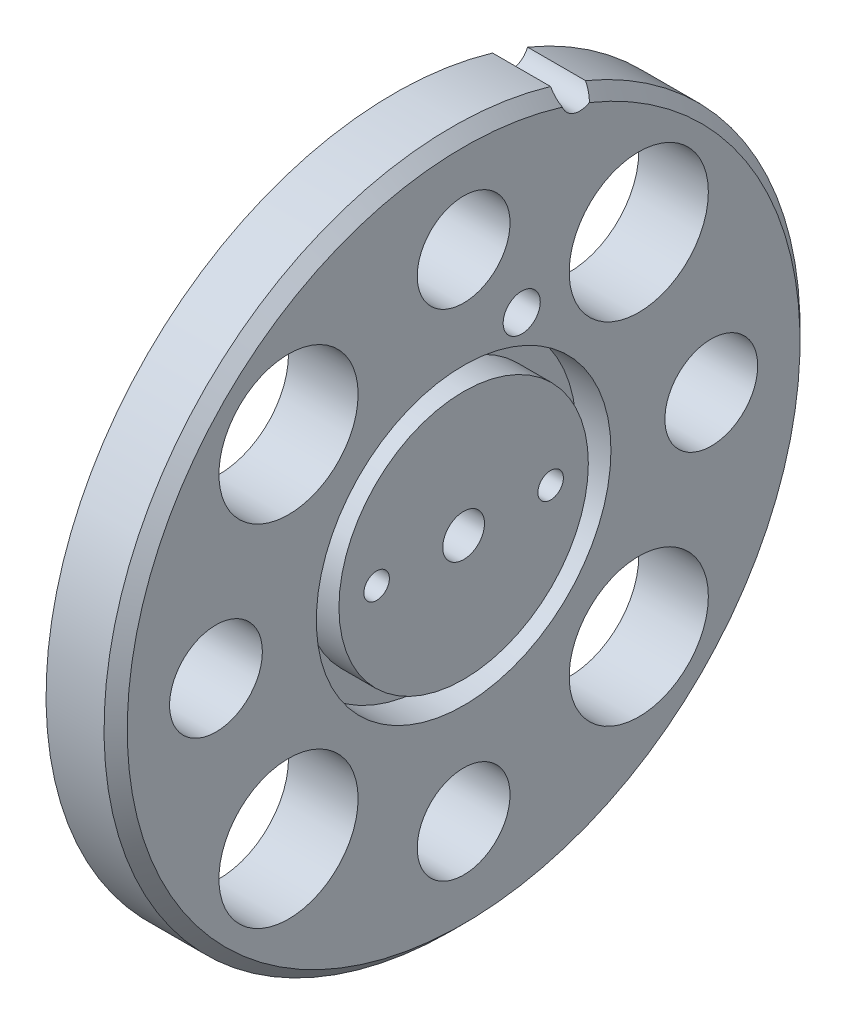
ISO-10303-21;
HEADER;
FILE_DESCRIPTION(('STEP AP214'),'2;1');
FILE_NAME('part.step','',(''),(''),'','','');
FILE_SCHEMA(('AUTOMOTIVE_DESIGN { 1 0 10303 214 1 1 1 1 }'));
ENDSEC;
DATA;
#1=APPLICATION_CONTEXT('core data for automotive mechanical design processes');
#2=APPLICATION_PROTOCOL_DEFINITION('international standard','automotive_design',2000,#1);
#3=PRODUCT_CONTEXT('',#1,'mechanical');
#4=PRODUCT('Part','Part','',(#3));
#5=PRODUCT_RELATED_PRODUCT_CATEGORY('part','',(#4));
#6=PRODUCT_DEFINITION_FORMATION('','',#4);
#7=PRODUCT_DEFINITION_CONTEXT('part definition',#1,'design');
#8=PRODUCT_DEFINITION('design','',#6,#7);
#9=PRODUCT_DEFINITION_SHAPE('','',#8);
#10=(LENGTH_UNIT() NAMED_UNIT(*) SI_UNIT(.MILLI.,.METRE.));
#11=(NAMED_UNIT(*) PLANE_ANGLE_UNIT() SI_UNIT($,.RADIAN.));
#12=(NAMED_UNIT(*) SI_UNIT($,.STERADIAN.) SOLID_ANGLE_UNIT());
#13=UNCERTAINTY_MEASURE_WITH_UNIT(LENGTH_MEASURE(1.E-05),#10,'distance_accuracy_value','');
#14=(GEOMETRIC_REPRESENTATION_CONTEXT(3) GLOBAL_UNCERTAINTY_ASSIGNED_CONTEXT((#13)) GLOBAL_UNIT_ASSIGNED_CONTEXT((#10,
#11,#12)) REPRESENTATION_CONTEXT('',''));
#15=CARTESIAN_POINT('',(0.,0.,0.));
#16=DIRECTION('',(0.,0.,1.));
#17=DIRECTION('',(1.,0.,0.));
#18=AXIS2_PLACEMENT_3D('',#15,#16,#17);
#19=CARTESIAN_POINT('',(6.,14.1396223663827,-5.00710288850657));
#20=DIRECTION('',(1.,0.,0.));
#21=DIRECTION('',(0.,0.,-1.));
#22=AXIS2_PLACEMENT_3D('',#19,#20,#21);
#23=PLANE('',#22);
#24=CARTESIAN_POINT('',(6.,0.,7.5));
#25=DIRECTION('',(1.,0.,0.));
#26=DIRECTION('',(0.,0.,1.));
#27=AXIS2_PLACEMENT_3D('',#24,#25,#26);
#28=CIRCLE('',#27,1.1);
#29=CARTESIAN_POINT('',(6.,0.,8.6));
#30=VERTEX_POINT('',#29);
#31=EDGE_CURVE('E186',#30,#30,#28,.T.);
#32=ORIENTED_EDGE('',*,*,#31,.F.);
#33=EDGE_LOOP('',(#32));
#34=FACE_BOUND('',#33,.T.);
#35=CARTESIAN_POINT('',(6.,0.,0.));
#36=DIRECTION('',(1.,0.,0.));
#37=DIRECTION('',(0.,0.,-1.));
#38=AXIS2_PLACEMENT_3D('',#35,#36,#37);
#39=CIRCLE('',#38,1.8);
#40=CARTESIAN_POINT('',(6.,0.,-1.8));
#41=VERTEX_POINT('',#40);
#42=EDGE_CURVE('E80',#41,#41,#39,.T.);
#43=ORIENTED_EDGE('',*,*,#42,.F.);
#44=EDGE_LOOP('',(#43));
#45=FACE_BOUND('',#44,.T.);
#46=CARTESIAN_POINT('',(6.,0.,-7.5));
#47=DIRECTION('',(1.,0.,0.));
#48=DIRECTION('',(0.,0.,-1.));
#49=AXIS2_PLACEMENT_3D('',#46,#47,#48);
#50=CIRCLE('',#49,1.1);
#51=CARTESIAN_POINT('',(6.,0.,-8.6));
#52=VERTEX_POINT('',#51);
#53=EDGE_CURVE('E192',#52,#52,#50,.T.);
#54=ORIENTED_EDGE('',*,*,#53,.F.);
#55=EDGE_LOOP('',(#54));
#56=FACE_BOUND('',#55,.T.);
#57=CARTESIAN_POINT('',(6.,0.,0.));
#58=DIRECTION('',(1.,0.,0.));
#59=DIRECTION('',(0.,0.,-1.));
#60=AXIS2_PLACEMENT_3D('',#57,#58,#59);
#61=CIRCLE('',#60,10.75);
#62=CARTESIAN_POINT('',(6.,0.,-10.75));
#63=VERTEX_POINT('',#62);
#64=EDGE_CURVE('E195',#63,#63,#61,.T.);
#65=ORIENTED_EDGE('',*,*,#64,.T.);
#66=EDGE_LOOP('',(#65));
#67=FACE_BOUND('',#66,.T.);
#68=ADVANCED_FACE('F32',(#34,#45,#56,#67),#23,.T.);
#69=CARTESIAN_POINT('',(6.,14.1396223663827,-5.00710288850657));
#70=DIRECTION('',(1.,0.,0.));
#71=DIRECTION('',(0.,0.,-1.));
#72=AXIS2_PLACEMENT_3D('',#69,#70,#71);
#73=CIRCLE('',#72,1.6);
#74=CARTESIAN_POINT('',(6.,14.1396223663827,-6.60710288850658));
#75=VERTEX_POINT('',#74);
#76=EDGE_CURVE('E203',#75,#75,#73,.T.);
#77=ORIENTED_EDGE('',*,*,#76,.F.);
#78=EDGE_LOOP('',(#77));
#79=FACE_BOUND('',#78,.T.);
#80=CARTESIAN_POINT('',(6.,0.,0.));
#81=DIRECTION('',(1.,0.,0.));
#82=DIRECTION('',(0.,0.,-1.));
#83=AXIS2_PLACEMENT_3D('',#80,#81,#82);
#84=CIRCLE('',#83,12.7);
#85=CARTESIAN_POINT('',(6.,0.,-12.7));
#86=VERTEX_POINT('',#85);
#87=EDGE_CURVE('E201',#86,#86,#84,.T.);
#88=ORIENTED_EDGE('',*,*,#87,.F.);
#89=EDGE_LOOP('',(#88));
#90=FACE_BOUND('',#89,.T.);
#91=CARTESIAN_POINT('',(6.,15.096729778333,15.0967297783326));
#92=DIRECTION('',(1.,0.,0.));
#93=DIRECTION('',(0.,0.,-1.));
#94=AXIS2_PLACEMENT_3D('',#91,#92,#93);
#95=CIRCLE('',#94,6.);
#96=CARTESIAN_POINT('',(6.,15.096729778333,9.09672977833255));
#97=VERTEX_POINT('',#96);
#98=EDGE_CURVE('E219',#97,#97,#95,.T.);
#99=ORIENTED_EDGE('',*,*,#98,.F.);
#100=EDGE_LOOP('',(#99));
#101=FACE_BOUND('',#100,.T.);
#102=CARTESIAN_POINT('',(6.,-15.0967297783326,15.096729778333));
#103=DIRECTION('',(1.,0.,0.));
#104=DIRECTION('',(0.,0.,-1.));
#105=AXIS2_PLACEMENT_3D('',#102,#103,#104);
#106=CIRCLE('',#105,6.);
#107=CARTESIAN_POINT('',(6.,-15.0967297783326,9.09672977833297));
#108=VERTEX_POINT('',#107);
#109=EDGE_CURVE('E231',#108,#108,#106,.T.);
#110=ORIENTED_EDGE('',*,*,#109,.F.);
#111=EDGE_LOOP('',(#110));
#112=FACE_BOUND('',#111,.T.);
#113=CARTESIAN_POINT('',(6.,-15.0967297783329,-15.0967297783327));
#114=DIRECTION('',(1.,0.,0.));
#115=DIRECTION('',(0.,0.,-1.));
#116=AXIS2_PLACEMENT_3D('',#113,#114,#115);
#117=CIRCLE('',#116,6.);
#118=CARTESIAN_POINT('',(6.,-15.0967297783329,-21.0967297783327));
#119=VERTEX_POINT('',#118);
#120=EDGE_CURVE('E243',#119,#119,#117,.T.);
#121=ORIENTED_EDGE('',*,*,#120,.F.);
#122=EDGE_LOOP('',(#121));
#123=FACE_BOUND('',#122,.T.);
#124=CARTESIAN_POINT('',(6.,15.0967297783327,-15.0967297783329));
#125=DIRECTION('',(1.,0.,0.));
#126=DIRECTION('',(0.,0.,-1.));
#127=AXIS2_PLACEMENT_3D('',#124,#125,#126);
#128=CIRCLE('',#127,6.);
#129=CARTESIAN_POINT('',(6.,15.0967297783327,-21.0967297783329));
#130=VERTEX_POINT('',#129);
#131=EDGE_CURVE('E255',#130,#130,#128,.T.);
#132=ORIENTED_EDGE('',*,*,#131,.F.);
#133=EDGE_LOOP('',(#132));
#134=FACE_BOUND('',#133,.T.);
#135=CARTESIAN_POINT('',(6.,28.2792447327653,-10.0142057770131));
#136=DIRECTION('',(-1.,0.,0.));
#137=DIRECTION('',(0.,0.,-1.));
#138=AXIS2_PLACEMENT_3D('',#135,#136,#137);
#139=CIRCLE('',#138,1.6);
#140=CARTESIAN_POINT('',(6.,26.9022694533807,-10.829030347067));
#141=VERTEX_POINT('',#140);
#142=CARTESIAN_POINT('',(6.,27.7219196724288,-8.51440953181153));
#143=VERTEX_POINT('',#142);
#144=EDGE_CURVE('E77',#141,#143,#139,.T.);
#145=ORIENTED_EDGE('',*,*,#144,.T.);
#146=CARTESIAN_POINT('',(6.,0.,0.));
#147=DIRECTION('',(1.,0.,0.));
#148=DIRECTION('',(0.,0.,-1.));
#149=AXIS2_PLACEMENT_3D('',#146,#147,#148);
#150=CIRCLE('',#149,29.);
#151=EDGE_CURVE('E70',#143,#141,#150,.T.);
#152=ORIENTED_EDGE('',*,*,#151,.T.);
#153=EDGE_LOOP('',(#145,#152));
#154=FACE_BOUND('',#153,.T.);
#155=CARTESIAN_POINT('',(6.,21.35,0.));
#156=DIRECTION('',(1.,0.,0.));
#157=DIRECTION('',(0.,0.,-1.));
#158=AXIS2_PLACEMENT_3D('',#155,#156,#157);
#159=CIRCLE('',#158,4.);
#160=CARTESIAN_POINT('',(6.,21.35,-4.));
#161=VERTEX_POINT('',#160);
#162=EDGE_CURVE('E249',#161,#161,#159,.T.);
#163=ORIENTED_EDGE('',*,*,#162,.F.);
#164=EDGE_LOOP('',(#163));
#165=FACE_BOUND('',#164,.T.);
#166=CARTESIAN_POINT('',(6.,0.,-21.35));
#167=DIRECTION('',(1.,0.,0.));
#168=DIRECTION('',(0.,0.,-1.));
#169=AXIS2_PLACEMENT_3D('',#166,#167,#168);
#170=CIRCLE('',#169,4.);
#171=CARTESIAN_POINT('',(6.,0.,-25.35));
#172=VERTEX_POINT('',#171);
#173=EDGE_CURVE('E237',#172,#172,#170,.T.);
#174=ORIENTED_EDGE('',*,*,#173,.F.);
#175=EDGE_LOOP('',(#174));
#176=FACE_BOUND('',#175,.T.);
#177=CARTESIAN_POINT('',(6.,-21.35,1.45616806216648E-13));
#178=DIRECTION('',(1.,0.,0.));
#179=DIRECTION('',(0.,0.,-1.));
#180=AXIS2_PLACEMENT_3D('',#177,#178,#179);
#181=CIRCLE('',#180,4.);
#182=CARTESIAN_POINT('',(6.,-21.35,-3.99999999999985));
#183=VERTEX_POINT('',#182);
#184=EDGE_CURVE('E225',#183,#183,#181,.T.);
#185=ORIENTED_EDGE('',*,*,#184,.F.);
#186=EDGE_LOOP('',(#185));
#187=FACE_BOUND('',#186,.T.);
#188=CARTESIAN_POINT('',(6.,2.23629379752903E-13,21.35));
#189=DIRECTION('',(1.,0.,0.));
#190=DIRECTION('',(0.,0.,-1.));
#191=AXIS2_PLACEMENT_3D('',#188,#189,#190);
#192=CIRCLE('',#191,4.);
#193=CARTESIAN_POINT('',(6.,2.23629379752903E-13,17.35));
#194=VERTEX_POINT('',#193);
#195=EDGE_CURVE('E213',#194,#194,#192,.T.);
#196=ORIENTED_EDGE('',*,*,#195,.F.);
#197=EDGE_LOOP('',(#196));
#198=FACE_BOUND('',#197,.T.);
#199=ADVANCED_FACE('F107',(#79,#90,#101,#112,#123,#134,#154,#165,#176,#187,#198),#23,.T.);
#200=CARTESIAN_POINT('',(0.,14.1396223663827,-5.00710288850657));
#201=DIRECTION('',(1.,0.,0.));
#202=DIRECTION('',(0.,0.,-1.));
#203=AXIS2_PLACEMENT_3D('',#200,#201,#202);
#204=PLANE('',#203);
#205=CARTESIAN_POINT('',(0.,15.096729778333,15.0967297783326));
#206=DIRECTION('',(1.,0.,0.));
#207=DIRECTION('',(0.,0.,-1.));
#208=AXIS2_PLACEMENT_3D('',#205,#206,#207);
#209=CIRCLE('',#208,6.);
#210=CARTESIAN_POINT('',(0.,15.096729778333,9.09672977833255));
#211=VERTEX_POINT('',#210);
#212=EDGE_CURVE('E216',#211,#211,#209,.T.);
#213=ORIENTED_EDGE('',*,*,#212,.T.);
#214=EDGE_LOOP('',(#213));
#215=FACE_BOUND('',#214,.T.);
#216=CARTESIAN_POINT('',(0.,-15.0967297783326,15.096729778333));
#217=DIRECTION('',(1.,0.,0.));
#218=DIRECTION('',(0.,0.,-1.));
#219=AXIS2_PLACEMENT_3D('',#216,#217,#218);
#220=CIRCLE('',#219,6.);
#221=CARTESIAN_POINT('',(0.,-15.0967297783326,9.09672977833297));
#222=VERTEX_POINT('',#221);
#223=EDGE_CURVE('E228',#222,#222,#220,.T.);
#224=ORIENTED_EDGE('',*,*,#223,.T.);
#225=EDGE_LOOP('',(#224));
#226=FACE_BOUND('',#225,.T.);
#227=CARTESIAN_POINT('',(0.,-15.0967297783329,-15.0967297783327));
#228=DIRECTION('',(1.,0.,0.));
#229=DIRECTION('',(0.,0.,-1.));
#230=AXIS2_PLACEMENT_3D('',#227,#228,#229);
#231=CIRCLE('',#230,6.);
#232=CARTESIAN_POINT('',(0.,-15.0967297783329,-21.0967297783327));
#233=VERTEX_POINT('',#232);
#234=EDGE_CURVE('E240',#233,#233,#231,.T.);
#235=ORIENTED_EDGE('',*,*,#234,.T.);
#236=EDGE_LOOP('',(#235));
#237=FACE_BOUND('',#236,.T.);
#238=CARTESIAN_POINT('',(0.,15.0967297783327,-15.0967297783329));
#239=DIRECTION('',(1.,0.,0.));
#240=DIRECTION('',(0.,0.,-1.));
#241=AXIS2_PLACEMENT_3D('',#238,#239,#240);
#242=CIRCLE('',#241,6.);
#243=CARTESIAN_POINT('',(0.,15.0967297783327,-21.0967297783329));
#244=VERTEX_POINT('',#243);
#245=EDGE_CURVE('E252',#244,#244,#242,.T.);
#246=ORIENTED_EDGE('',*,*,#245,.T.);
#247=EDGE_LOOP('',(#246));
#248=FACE_BOUND('',#247,.T.);
#249=CARTESIAN_POINT('',(0.,0.,-7.5));
#250=DIRECTION('',(1.,0.,0.));
#251=DIRECTION('',(0.,0.,-1.));
#252=AXIS2_PLACEMENT_3D('',#249,#250,#251);
#253=CIRCLE('',#252,1.1);
#254=CARTESIAN_POINT('',(0.,0.,-8.6));
#255=VERTEX_POINT('',#254);
#256=EDGE_CURVE('E262',#255,#255,#253,.T.);
#257=ORIENTED_EDGE('',*,*,#256,.T.);
#258=EDGE_LOOP('',(#257));
#259=FACE_BOUND('',#258,.T.);
#260=CARTESIAN_POINT('',(0.,28.2792447327653,-10.0142057770131));
#261=DIRECTION('',(-1.,0.,0.));
#262=DIRECTION('',(0.,0.,-1.));
#263=AXIS2_PLACEMENT_3D('',#260,#261,#262);
#264=CIRCLE('',#263,1.6);
#265=CARTESIAN_POINT('',(0.,27.7051243204898,-11.5076533831274));
#266=VERTEX_POINT('',#265);
#267=CARTESIAN_POINT('',(0.,28.7729264044677,-8.49227331891089));
#268=VERTEX_POINT('',#267);
#269=EDGE_CURVE('E76',#266,#268,#264,.T.);
#270=ORIENTED_EDGE('',*,*,#269,.F.);
#271=CARTESIAN_POINT('',(0.,0.,0.));
#272=DIRECTION('',(1.,0.,0.));
#273=DIRECTION('',(0.,0.,-1.));
#274=AXIS2_PLACEMENT_3D('',#271,#272,#273);
#275=CIRCLE('',#274,30.);
#276=EDGE_CURVE('E66',#268,#266,#275,.T.);
#277=ORIENTED_EDGE('',*,*,#276,.F.);
#278=EDGE_LOOP('',(#270,#277));
#279=FACE_BOUND('',#278,.T.);
#280=CARTESIAN_POINT('',(0.,0.,0.));
#281=DIRECTION('',(1.,0.,0.));
#282=DIRECTION('',(0.,0.,-1.));
#283=AXIS2_PLACEMENT_3D('',#280,#281,#282);
#284=CIRCLE('',#283,1.8);
#285=CARTESIAN_POINT('',(0.,0.,-1.8));
#286=VERTEX_POINT('',#285);
#287=EDGE_CURVE('E83',#286,#286,#284,.T.);
#288=ORIENTED_EDGE('',*,*,#287,.T.);
#289=EDGE_LOOP('',(#288));
#290=FACE_BOUND('',#289,.T.);
#291=CARTESIAN_POINT('',(0.,0.,7.5));
#292=DIRECTION('',(1.,0.,0.));
#293=DIRECTION('',(0.,0.,1.));
#294=AXIS2_PLACEMENT_3D('',#291,#292,#293);
#295=CIRCLE('',#294,1.1);
#296=CARTESIAN_POINT('',(0.,0.,8.6));
#297=VERTEX_POINT('',#296);
#298=EDGE_CURVE('E258',#297,#297,#295,.T.);
#299=ORIENTED_EDGE('',*,*,#298,.T.);
#300=EDGE_LOOP('',(#299));
#301=FACE_BOUND('',#300,.T.);
#302=CARTESIAN_POINT('',(0.,21.35,0.));
#303=DIRECTION('',(1.,0.,0.));
#304=DIRECTION('',(0.,0.,-1.));
#305=AXIS2_PLACEMENT_3D('',#302,#303,#304);
#306=CIRCLE('',#305,4.);
#307=CARTESIAN_POINT('',(0.,21.35,-4.));
#308=VERTEX_POINT('',#307);
#309=EDGE_CURVE('E246',#308,#308,#306,.T.);
#310=ORIENTED_EDGE('',*,*,#309,.T.);
#311=EDGE_LOOP('',(#310));
#312=FACE_BOUND('',#311,.T.);
#313=CARTESIAN_POINT('',(0.,0.,-21.35));
#314=DIRECTION('',(1.,0.,0.));
#315=DIRECTION('',(0.,0.,-1.));
#316=AXIS2_PLACEMENT_3D('',#313,#314,#315);
#317=CIRCLE('',#316,4.);
#318=CARTESIAN_POINT('',(0.,0.,-25.35));
#319=VERTEX_POINT('',#318);
#320=EDGE_CURVE('E234',#319,#319,#317,.T.);
#321=ORIENTED_EDGE('',*,*,#320,.T.);
#322=EDGE_LOOP('',(#321));
#323=FACE_BOUND('',#322,.T.);
#324=CARTESIAN_POINT('',(0.,-21.35,1.45616806216648E-13));
#325=DIRECTION('',(1.,0.,0.));
#326=DIRECTION('',(0.,0.,-1.));
#327=AXIS2_PLACEMENT_3D('',#324,#325,#326);
#328=CIRCLE('',#327,4.);
#329=CARTESIAN_POINT('',(0.,-21.35,-3.99999999999985));
#330=VERTEX_POINT('',#329);
#331=EDGE_CURVE('E222',#330,#330,#328,.T.);
#332=ORIENTED_EDGE('',*,*,#331,.T.);
#333=EDGE_LOOP('',(#332));
#334=FACE_BOUND('',#333,.T.);
#335=CARTESIAN_POINT('',(0.,2.23629379752903E-13,21.35));
#336=DIRECTION('',(1.,0.,0.));
#337=DIRECTION('',(0.,0.,-1.));
#338=AXIS2_PLACEMENT_3D('',#335,#336,#337);
#339=CIRCLE('',#338,4.);
#340=CARTESIAN_POINT('',(0.,2.23629379752903E-13,17.35));
#341=VERTEX_POINT('',#340);
#342=EDGE_CURVE('E210',#341,#341,#339,.T.);
#343=ORIENTED_EDGE('',*,*,#342,.T.);
#344=EDGE_LOOP('',(#343));
#345=FACE_BOUND('',#344,.T.);
#346=ADVANCED_FACE('F74',(#215,#226,#237,#248,#259,#279,#290,#301,#312,#323,#334,#345),#204,.F.);
#347=CARTESIAN_POINT('',(6.,28.2792447327653,-10.0142057770131));
#348=DIRECTION('',(-1.,0.,0.));
#349=DIRECTION('',(0.,0.,1.));
#350=AXIS2_PLACEMENT_3D('',#347,#348,#349);
#351=CYLINDRICAL_SURFACE('',#350,1.6);
#352=ORIENTED_EDGE('',*,*,#144,.F.);
#353=CARTESIAN_POINT('',(6.,26.9022694533807,-10.829030347067));
#354=CARTESIAN_POINT('',(5.95748152019924,26.9295529538725,-10.8751093636154));
#355=CARTESIAN_POINT('',(5.91396375522709,26.958696102256,-10.9191081823422));
#356=CARTESIAN_POINT('',(5.82537172577946,27.0202565363291,-11.002974342158));
#357=CARTESIAN_POINT('',(5.78029879158953,27.0526710672507,-11.0428451030183));
#358=CARTESIAN_POINT('',(5.68972673290477,27.1198122406809,-11.1179302610488));
#359=CARTESIAN_POINT('',(5.64424721098313,27.1544913806564,-11.1532111530702));
#360=CARTESIAN_POINT('',(5.55243042388235,27.2263266478308,-11.2199279143867));
#361=CARTESIAN_POINT('',(5.50609302944252,27.263483150539,-11.2513631987226));
#362=CARTESIAN_POINT('',(5.38437571343891,27.3633397731233,-11.3284284115042));
#363=CARTESIAN_POINT('',(5.30850944959288,27.4278045943657,-11.3710310297582));
#364=CARTESIAN_POINT('',(5.15505865362141,27.5625017435481,-11.4467893886981));
#365=CARTESIAN_POINT('',(5.07746482755841,27.6328010642749,-11.4798075058112));
#366=CARTESIAN_POINT('',(4.99999999999998,27.7051243204898,-11.5076533831275));
#367=B_SPLINE_CURVE_WITH_KNOTS('',3,(#353,#354,#355,#356,#357,#358,#359,#360,#361,#362,#363,
#364,#365,#366),.UNSPECIFIED.,.F.,.F.,(4,2,2,2,2,2,4),(0.,0.205012461223851,0.409853703469577,
0.611283140930392,0.812743180026222,1.1370018317428,1.46570909723937),.UNSPECIFIED.);
#368=CARTESIAN_POINT('',(4.99999999999998,27.7051243204898,-11.5076533831274));
#369=VERTEX_POINT('',#368);
#370=EDGE_CURVE('E41',#141,#369,#367,.T.);
#371=ORIENTED_EDGE('',*,*,#370,.T.);
#372=DIRECTION('',(-1.,0.,0.));
#373=VECTOR('',#372,1.);
#374=CARTESIAN_POINT('',(6.,27.7051243204898,-11.5076533831274));
#375=LINE('',#374,#373);
#376=EDGE_CURVE('E71',#369,#266,#375,.T.);
#377=ORIENTED_EDGE('',*,*,#376,.T.);
#378=ORIENTED_EDGE('',*,*,#269,.T.);
#379=DIRECTION('',(-1.,0.,0.));
#380=VECTOR('',#379,1.);
#381=CARTESIAN_POINT('',(6.,28.7729264044677,-8.49227331891089));
#382=LINE('',#381,#380);
#383=CARTESIAN_POINT('',(4.99999999999998,28.7729264044677,-8.49227331891089));
#384=VERTEX_POINT('',#383);
#385=EDGE_CURVE('E63',#384,#268,#382,.T.);
#386=ORIENTED_EDGE('',*,*,#385,.F.);
#387=CARTESIAN_POINT('',(4.99999999999998,28.7729264044677,-8.49227331891089));
#388=CARTESIAN_POINT('',(5.06262589698945,28.7133267812632,-8.47296011098664));
#389=CARTESIAN_POINT('',(5.12531277029409,28.6526428783644,-8.45712576825959));
#390=CARTESIAN_POINT('',(5.25044373557945,28.5294053532571,-8.43262770821674));
#391=CARTESIAN_POINT('',(5.31288728994577,28.4668489377996,-8.42397531950593));
#392=CARTESIAN_POINT('',(5.43553160612705,28.3418184680971,-8.41423039050746));
#393=CARTESIAN_POINT('',(5.4957508347309,28.2793759845721,-8.41296759892772));
#394=CARTESIAN_POINT('',(5.61485866447945,28.1536108949364,-8.41790597964186));
#395=CARTESIAN_POINT('',(5.67374846231312,28.0902891705848,-8.42410014238706));
#396=CARTESIAN_POINT('',(5.77767614636705,27.9762744075663,-8.44232092264019));
#397=CARTESIAN_POINT('',(5.8230667683746,27.925669191542,-8.45288182246745));
#398=CARTESIAN_POINT('',(5.91265644802329,27.8239709704875,-8.47944142140143));
#399=CARTESIAN_POINT('',(5.95684055023661,27.7728777943182,-8.4954896447831));
#400=CARTESIAN_POINT('',(6.,27.7219196724288,-8.51440953181153));
#401=B_SPLINE_CURVE_WITH_KNOTS('',3,(#387,#388,#389,#390,#391,#392,#393,#394,#395,#396,#397,
#398,#399,#400),.UNSPECIFIED.,.F.,.F.,(4,2,2,2,2,2,4),(0.,0.265699234545622,0.531816783140644,
0.791778252306828,1.05149554797202,1.25766844705409,1.46575348943601),.UNSPECIFIED.);
#402=EDGE_CURVE('E91',#384,#143,#401,.T.);
#403=ORIENTED_EDGE('',*,*,#402,.T.);
#404=EDGE_LOOP('',(#352,#371,#377,#378,#386,#403));
#405=FACE_BOUND('',#404,.T.);
#406=ADVANCED_FACE('F79',(#405),#351,.F.);
#407=CARTESIAN_POINT('',(6.,0.,0.));
#408=DIRECTION('',(-1.,0.,0.));
#409=DIRECTION('',(0.,0.,1.));
#410=AXIS2_PLACEMENT_3D('',#407,#408,#409);
#411=CYLINDRICAL_SURFACE('',#410,30.);
#412=ORIENTED_EDGE('',*,*,#376,.F.);
#413=CARTESIAN_POINT('',(4.99999999999998,0.,0.));
#414=DIRECTION('',(1.,0.,0.));
#415=DIRECTION('',(0.,0.,-1.));
#416=AXIS2_PLACEMENT_3D('',#413,#414,#415);
#417=CIRCLE('',#416,30.);
#418=EDGE_CURVE('E11',#369,#384,#417,.F.);
#419=ORIENTED_EDGE('',*,*,#418,.T.);
#420=ORIENTED_EDGE('',*,*,#385,.T.);
#421=ORIENTED_EDGE('',*,*,#276,.T.);
#422=EDGE_LOOP('',(#412,#419,#420,#421));
#423=FACE_BOUND('',#422,.T.);
#424=ADVANCED_FACE('F65',(#423),#411,.T.);
#425=CARTESIAN_POINT('',(6.,0.,0.));
#426=DIRECTION('',(-1.,0.,0.));
#427=DIRECTION('',(0.,0.,1.));
#428=AXIS2_PLACEMENT_3D('',#425,#426,#427);
#429=CYLINDRICAL_SURFACE('',#428,1.8);
#430=ORIENTED_EDGE('',*,*,#42,.T.);
#431=EDGE_LOOP('',(#430));
#432=FACE_BOUND('',#431,.T.);
#433=ORIENTED_EDGE('',*,*,#287,.F.);
#434=EDGE_LOOP('',(#433));
#435=FACE_BOUND('',#434,.T.);
#436=ADVANCED_FACE('F104',(#432,#435),#429,.F.);
#437=CARTESIAN_POINT('',(6.,0.,-7.5));
#438=DIRECTION('',(-1.,0.,0.));
#439=DIRECTION('',(0.,0.,1.));
#440=AXIS2_PLACEMENT_3D('',#437,#438,#439);
#441=CYLINDRICAL_SURFACE('',#440,1.1);
#442=ORIENTED_EDGE('',*,*,#53,.T.);
#443=EDGE_LOOP('',(#442));
#444=FACE_BOUND('',#443,.T.);
#445=ORIENTED_EDGE('',*,*,#256,.F.);
#446=EDGE_LOOP('',(#445));
#447=FACE_BOUND('',#446,.T.);
#448=ADVANCED_FACE('F114',(#444,#447),#441,.F.);
#449=CARTESIAN_POINT('',(6.,0.,7.5));
#450=DIRECTION('',(-1.,0.,0.));
#451=DIRECTION('',(0.,0.,1.));
#452=AXIS2_PLACEMENT_3D('',#449,#450,#451);
#453=CYLINDRICAL_SURFACE('',#452,1.1);
#454=ORIENTED_EDGE('',*,*,#31,.T.);
#455=EDGE_LOOP('',(#454));
#456=FACE_BOUND('',#455,.T.);
#457=ORIENTED_EDGE('',*,*,#298,.F.);
#458=EDGE_LOOP('',(#457));
#459=FACE_BOUND('',#458,.T.);
#460=ADVANCED_FACE('F118',(#456,#459),#453,.F.);
#461=CARTESIAN_POINT('',(6.,15.0967297783327,-15.0967297783329));
#462=DIRECTION('',(-1.,0.,0.));
#463=DIRECTION('',(0.,0.,1.));
#464=AXIS2_PLACEMENT_3D('',#461,#462,#463);
#465=CYLINDRICAL_SURFACE('',#464,6.);
#466=ORIENTED_EDGE('',*,*,#131,.T.);
#467=EDGE_LOOP('',(#466));
#468=FACE_BOUND('',#467,.T.);
#469=ORIENTED_EDGE('',*,*,#245,.F.);
#470=EDGE_LOOP('',(#469));
#471=FACE_BOUND('',#470,.T.);
#472=ADVANCED_FACE('F122',(#468,#471),#465,.F.);
#473=CARTESIAN_POINT('',(6.,21.35,0.));
#474=DIRECTION('',(-1.,0.,0.));
#475=DIRECTION('',(0.,0.,1.));
#476=AXIS2_PLACEMENT_3D('',#473,#474,#475);
#477=CYLINDRICAL_SURFACE('',#476,4.);
#478=ORIENTED_EDGE('',*,*,#162,.T.);
#479=EDGE_LOOP('',(#478));
#480=FACE_BOUND('',#479,.T.);
#481=ORIENTED_EDGE('',*,*,#309,.F.);
#482=EDGE_LOOP('',(#481));
#483=FACE_BOUND('',#482,.T.);
#484=ADVANCED_FACE('F126',(#480,#483),#477,.F.);
#485=CARTESIAN_POINT('',(6.,-15.0967297783329,-15.0967297783327));
#486=DIRECTION('',(-1.,0.,0.));
#487=DIRECTION('',(0.,0.,1.));
#488=AXIS2_PLACEMENT_3D('',#485,#486,#487);
#489=CYLINDRICAL_SURFACE('',#488,6.);
#490=ORIENTED_EDGE('',*,*,#120,.T.);
#491=EDGE_LOOP('',(#490));
#492=FACE_BOUND('',#491,.T.);
#493=ORIENTED_EDGE('',*,*,#234,.F.);
#494=EDGE_LOOP('',(#493));
#495=FACE_BOUND('',#494,.T.);
#496=ADVANCED_FACE('F130',(#492,#495),#489,.F.);
#497=CARTESIAN_POINT('',(6.,0.,-21.35));
#498=DIRECTION('',(-1.,0.,0.));
#499=DIRECTION('',(0.,0.,1.));
#500=AXIS2_PLACEMENT_3D('',#497,#498,#499);
#501=CYLINDRICAL_SURFACE('',#500,4.);
#502=ORIENTED_EDGE('',*,*,#173,.T.);
#503=EDGE_LOOP('',(#502));
#504=FACE_BOUND('',#503,.T.);
#505=ORIENTED_EDGE('',*,*,#320,.F.);
#506=EDGE_LOOP('',(#505));
#507=FACE_BOUND('',#506,.T.);
#508=ADVANCED_FACE('F134',(#504,#507),#501,.F.);
#509=CARTESIAN_POINT('',(6.,-15.0967297783326,15.096729778333));
#510=DIRECTION('',(-1.,0.,0.));
#511=DIRECTION('',(0.,0.,1.));
#512=AXIS2_PLACEMENT_3D('',#509,#510,#511);
#513=CYLINDRICAL_SURFACE('',#512,6.);
#514=ORIENTED_EDGE('',*,*,#109,.T.);
#515=EDGE_LOOP('',(#514));
#516=FACE_BOUND('',#515,.T.);
#517=ORIENTED_EDGE('',*,*,#223,.F.);
#518=EDGE_LOOP('',(#517));
#519=FACE_BOUND('',#518,.T.);
#520=ADVANCED_FACE('F138',(#516,#519),#513,.F.);
#521=CARTESIAN_POINT('',(6.,-21.35,1.45616806216648E-13));
#522=DIRECTION('',(-1.,0.,0.));
#523=DIRECTION('',(0.,0.,1.));
#524=AXIS2_PLACEMENT_3D('',#521,#522,#523);
#525=CYLINDRICAL_SURFACE('',#524,4.);
#526=ORIENTED_EDGE('',*,*,#184,.T.);
#527=EDGE_LOOP('',(#526));
#528=FACE_BOUND('',#527,.T.);
#529=ORIENTED_EDGE('',*,*,#331,.F.);
#530=EDGE_LOOP('',(#529));
#531=FACE_BOUND('',#530,.T.);
#532=ADVANCED_FACE('F142',(#528,#531),#525,.F.);
#533=CARTESIAN_POINT('',(6.,15.096729778333,15.0967297783326));
#534=DIRECTION('',(-1.,0.,0.));
#535=DIRECTION('',(0.,0.,1.));
#536=AXIS2_PLACEMENT_3D('',#533,#534,#535);
#537=CYLINDRICAL_SURFACE('',#536,6.);
#538=ORIENTED_EDGE('',*,*,#98,.T.);
#539=EDGE_LOOP('',(#538));
#540=FACE_BOUND('',#539,.T.);
#541=ORIENTED_EDGE('',*,*,#212,.F.);
#542=EDGE_LOOP('',(#541));
#543=FACE_BOUND('',#542,.T.);
#544=ADVANCED_FACE('F146',(#540,#543),#537,.F.);
#545=CARTESIAN_POINT('',(6.,2.23629379752903E-13,21.35));
#546=DIRECTION('',(-1.,0.,0.));
#547=DIRECTION('',(0.,0.,1.));
#548=AXIS2_PLACEMENT_3D('',#545,#546,#547);
#549=CYLINDRICAL_SURFACE('',#548,4.);
#550=ORIENTED_EDGE('',*,*,#195,.T.);
#551=EDGE_LOOP('',(#550));
#552=FACE_BOUND('',#551,.T.);
#553=ORIENTED_EDGE('',*,*,#342,.F.);
#554=EDGE_LOOP('',(#553));
#555=FACE_BOUND('',#554,.T.);
#556=ADVANCED_FACE('F150',(#552,#555),#549,.F.);
#557=CARTESIAN_POINT('',(3.,0.,0.));
#558=DIRECTION('',(1.,0.,0.));
#559=DIRECTION('',(0.,0.,-1.));
#560=AXIS2_PLACEMENT_3D('',#557,#558,#559);
#561=CYLINDRICAL_SURFACE('',#560,12.7);
#562=CARTESIAN_POINT('',(3.,0.,0.));
#563=DIRECTION('',(1.,0.,0.));
#564=DIRECTION('',(0.,0.,-1.));
#565=AXIS2_PLACEMENT_3D('',#562,#563,#564);
#566=CIRCLE('',#565,12.7);
#567=CARTESIAN_POINT('',(3.,0.,-12.7));
#568=VERTEX_POINT('',#567);
#569=EDGE_CURVE('E207',#568,#568,#566,.T.);
#570=ORIENTED_EDGE('',*,*,#569,.F.);
#571=EDGE_LOOP('',(#570));
#572=FACE_BOUND('',#571,.T.);
#573=ORIENTED_EDGE('',*,*,#87,.T.);
#574=EDGE_LOOP('',(#573));
#575=FACE_BOUND('',#574,.T.);
#576=ADVANCED_FACE('F154',(#572,#575),#561,.F.);
#577=CARTESIAN_POINT('',(3.,0.,0.));
#578=DIRECTION('',(1.,0.,0.));
#579=DIRECTION('',(0.,0.,-1.));
#580=AXIS2_PLACEMENT_3D('',#577,#578,#579);
#581=PLANE('',#580);
#582=CARTESIAN_POINT('',(3.,0.,0.));
#583=DIRECTION('',(1.,0.,0.));
#584=DIRECTION('',(0.,0.,-1.));
#585=AXIS2_PLACEMENT_3D('',#582,#583,#584);
#586=CIRCLE('',#585,10.75);
#587=CARTESIAN_POINT('',(3.,0.,-10.75));
#588=VERTEX_POINT('',#587);
#589=EDGE_CURVE('E197',#588,#588,#586,.T.);
#590=ORIENTED_EDGE('',*,*,#589,.F.);
#591=EDGE_LOOP('',(#590));
#592=FACE_BOUND('',#591,.T.);
#593=ORIENTED_EDGE('',*,*,#569,.T.);
#594=EDGE_LOOP('',(#593));
#595=FACE_BOUND('',#594,.T.);
#596=ADVANCED_FACE('F158',(#592,#595),#581,.T.);
#597=CARTESIAN_POINT('',(3.,0.,0.));
#598=DIRECTION('',(1.,0.,0.));
#599=DIRECTION('',(0.,0.,-1.));
#600=AXIS2_PLACEMENT_3D('',#597,#598,#599);
#601=CYLINDRICAL_SURFACE('',#600,10.75);
#602=ORIENTED_EDGE('',*,*,#589,.T.);
#603=EDGE_LOOP('',(#602));
#604=FACE_BOUND('',#603,.T.);
#605=ORIENTED_EDGE('',*,*,#64,.F.);
#606=EDGE_LOOP('',(#605));
#607=FACE_BOUND('',#606,.T.);
#608=ADVANCED_FACE('F162',(#604,#607),#601,.T.);
#609=CARTESIAN_POINT('',(3.,14.1396223663827,-5.00710288850657));
#610=DIRECTION('',(1.,0.,0.));
#611=DIRECTION('',(0.,0.,-1.));
#612=AXIS2_PLACEMENT_3D('',#609,#610,#611);
#613=CYLINDRICAL_SURFACE('',#612,1.6);
#614=CARTESIAN_POINT('',(3.,14.1396223663827,-5.00710288850657));
#615=DIRECTION('',(1.,0.,0.));
#616=DIRECTION('',(0.,0.,-1.));
#617=AXIS2_PLACEMENT_3D('',#614,#615,#616);
#618=CIRCLE('',#617,1.6);
#619=CARTESIAN_POINT('',(3.,14.1396223663827,-6.60710288850658));
#620=VERTEX_POINT('',#619);
#621=EDGE_CURVE('E198',#620,#620,#618,.T.);
#622=ORIENTED_EDGE('',*,*,#621,.F.);
#623=EDGE_LOOP('',(#622));
#624=FACE_BOUND('',#623,.T.);
#625=ORIENTED_EDGE('',*,*,#76,.T.);
#626=EDGE_LOOP('',(#625));
#627=FACE_BOUND('',#626,.T.);
#628=ADVANCED_FACE('F166',(#624,#627),#613,.F.);
#629=CARTESIAN_POINT('',(3.,14.1396223663827,-5.00710288850657));
#630=DIRECTION('',(1.,0.,0.));
#631=DIRECTION('',(0.,0.,-1.));
#632=AXIS2_PLACEMENT_3D('',#629,#630,#631);
#633=PLANE('',#632);
#634=ORIENTED_EDGE('',*,*,#621,.T.);
#635=EDGE_LOOP('',(#634));
#636=FACE_BOUND('',#635,.T.);
#637=ADVANCED_FACE('F170',(#636),#633,.T.);
#638=CARTESIAN_POINT('',(6.,0.,0.));
#639=DIRECTION('',(-1.,0.,0.));
#640=DIRECTION('',(0.,0.,1.));
#641=AXIS2_PLACEMENT_3D('',#638,#639,#640);
#642=CONICAL_SURFACE('',#641,29.,0.785398163397452);
#643=ORIENTED_EDGE('',*,*,#402,.F.);
#644=ORIENTED_EDGE('',*,*,#418,.F.);
#645=ORIENTED_EDGE('',*,*,#370,.F.);
#646=ORIENTED_EDGE('',*,*,#151,.F.);
#647=EDGE_LOOP('',(#643,#644,#645,#646));
#648=FACE_BOUND('',#647,.T.);
#649=ADVANCED_FACE('F34',(#648),#642,.T.);
#650=CLOSED_SHELL('',(#68,#199,#346,#406,#424,#436,#448,#460,#472,#484,#496,#508,#520,#532,#544,
#556,#576,#596,#608,#628,#637,#649));
#651=MANIFOLD_SOLID_BREP('B2',#650);
#652=ADVANCED_BREP_SHAPE_REPRESENTATION('',(#18,#651),#14);
#653=SHAPE_DEFINITION_REPRESENTATION(#9,#652);
ENDSEC;
END-ISO-10303-21;
